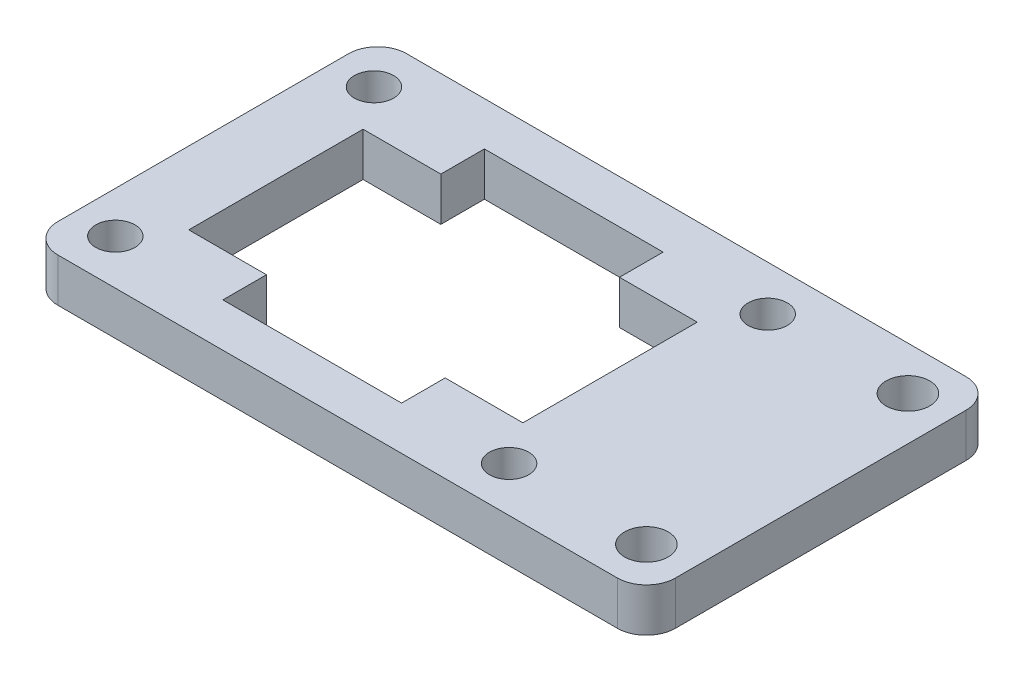
ISO-10303-21;
HEADER;
FILE_DESCRIPTION(('STEP AP214'),'2;1');
FILE_NAME('part.step','',(''),(''),'','','');
FILE_SCHEMA(('AUTOMOTIVE_DESIGN { 1 0 10303 214 1 1 1 1 }'));
ENDSEC;
DATA;
#1=APPLICATION_CONTEXT('core data for automotive mechanical design processes');
#2=APPLICATION_PROTOCOL_DEFINITION('international standard','automotive_design',2000,#1);
#3=PRODUCT_CONTEXT('',#1,'mechanical');
#4=PRODUCT('Part','Part','',(#3));
#5=PRODUCT_RELATED_PRODUCT_CATEGORY('part','',(#4));
#6=PRODUCT_DEFINITION_FORMATION('','',#4);
#7=PRODUCT_DEFINITION_CONTEXT('part definition',#1,'design');
#8=PRODUCT_DEFINITION('design','',#6,#7);
#9=PRODUCT_DEFINITION_SHAPE('','',#8);
#10=(LENGTH_UNIT() NAMED_UNIT(*) SI_UNIT(.MILLI.,.METRE.));
#11=(NAMED_UNIT(*) PLANE_ANGLE_UNIT() SI_UNIT($,.RADIAN.));
#12=(NAMED_UNIT(*) SI_UNIT($,.STERADIAN.) SOLID_ANGLE_UNIT());
#13=UNCERTAINTY_MEASURE_WITH_UNIT(LENGTH_MEASURE(1.E-05),#10,'distance_accuracy_value','');
#14=(GEOMETRIC_REPRESENTATION_CONTEXT(3) GLOBAL_UNCERTAINTY_ASSIGNED_CONTEXT((#13)) GLOBAL_UNIT_ASSIGNED_CONTEXT((#10,
#11,#12)) REPRESENTATION_CONTEXT('',''));
#15=CARTESIAN_POINT('',(0.,0.,0.));
#16=DIRECTION('',(0.,0.,1.));
#17=DIRECTION('',(1.,0.,0.));
#18=AXIS2_PLACEMENT_3D('',#15,#16,#17);
#19=CARTESIAN_POINT('',(0.,3.,-6.));
#20=DIRECTION('',(0.,0.,-1.));
#21=DIRECTION('',(-1.,0.,0.));
#22=AXIS2_PLACEMENT_3D('',#19,#20,#21);
#23=PLANE('',#22);
#24=DIRECTION('',(0.,1.,0.));
#25=VECTOR('',#24,1.);
#26=CARTESIAN_POINT('',(22.65,0.,-6.));
#27=LINE('',#26,#25);
#28=CARTESIAN_POINT('',(22.65,0.,-6.));
#29=VERTEX_POINT('',#28);
#30=CARTESIAN_POINT('',(22.65,3.,-6.));
#31=VERTEX_POINT('',#30);
#32=EDGE_CURVE('E329',#29,#31,#27,.T.);
#33=ORIENTED_EDGE('',*,*,#32,.T.);
#34=DIRECTION('',(1.,0.,0.));
#35=VECTOR('',#34,1.);
#36=CARTESIAN_POINT('',(0.,3.,-6.));
#37=LINE('',#36,#35);
#38=CARTESIAN_POINT('',(28.,3.,-6.));
#39=VERTEX_POINT('',#38);
#40=EDGE_CURVE('E358',#31,#39,#37,.T.);
#41=ORIENTED_EDGE('',*,*,#40,.T.);
#42=DIRECTION('',(0.,-1.,0.));
#43=VECTOR('',#42,1.);
#44=CARTESIAN_POINT('',(28.,3.,-6.));
#45=LINE('',#44,#43);
#46=CARTESIAN_POINT('',(28.,0.,-6.));
#47=VERTEX_POINT('',#46);
#48=EDGE_CURVE('E222',#39,#47,#45,.T.);
#49=ORIENTED_EDGE('',*,*,#48,.T.);
#50=DIRECTION('',(1.,0.,0.));
#51=VECTOR('',#50,1.);
#52=CARTESIAN_POINT('',(0.,0.,-6.));
#53=LINE('',#52,#51);
#54=EDGE_CURVE('E289',#29,#47,#53,.T.);
#55=ORIENTED_EDGE('',*,*,#54,.F.);
#56=EDGE_LOOP('',(#33,#41,#49,#55));
#57=FACE_BOUND('',#56,.T.);
#58=ADVANCED_FACE('F35',(#57),#23,.T.);
#59=CARTESIAN_POINT('',(0.,3.,-3.));
#60=DIRECTION('',(0.,0.,-1.));
#61=DIRECTION('',(-1.,0.,0.));
#62=AXIS2_PLACEMENT_3D('',#59,#60,#61);
#63=PLANE('',#62);
#64=DIRECTION('',(1.,0.,0.));
#65=VECTOR('',#64,1.);
#66=CARTESIAN_POINT('',(0.,0.,-3.));
#67=LINE('',#66,#65);
#68=CARTESIAN_POINT('',(10.35,0.,-3.));
#69=VERTEX_POINT('',#68);
#70=CARTESIAN_POINT('',(22.65,0.,-3.));
#71=VERTEX_POINT('',#70);
#72=EDGE_CURVE('E291',#69,#71,#67,.T.);
#73=ORIENTED_EDGE('',*,*,#72,.F.);
#74=DIRECTION('',(0.,1.,0.));
#75=VECTOR('',#74,1.);
#76=CARTESIAN_POINT('',(10.35,0.,-3.));
#77=LINE('',#76,#75);
#78=CARTESIAN_POINT('',(10.35,3.,-3.));
#79=VERTEX_POINT('',#78);
#80=EDGE_CURVE('E307',#69,#79,#77,.T.);
#81=ORIENTED_EDGE('',*,*,#80,.T.);
#82=DIRECTION('',(1.,0.,0.));
#83=VECTOR('',#82,1.);
#84=CARTESIAN_POINT('',(0.,3.,-3.));
#85=LINE('',#84,#83);
#86=CARTESIAN_POINT('',(22.65,3.,-3.));
#87=VERTEX_POINT('',#86);
#88=EDGE_CURVE('E360',#79,#87,#85,.T.);
#89=ORIENTED_EDGE('',*,*,#88,.T.);
#90=DIRECTION('',(0.,1.,0.));
#91=VECTOR('',#90,1.);
#92=CARTESIAN_POINT('',(22.65,0.,-3.));
#93=LINE('',#92,#91);
#94=EDGE_CURVE('E327',#71,#87,#93,.T.);
#95=ORIENTED_EDGE('',*,*,#94,.F.);
#96=EDGE_LOOP('',(#73,#81,#89,#95));
#97=FACE_BOUND('',#96,.T.);
#98=ADVANCED_FACE('F404',(#97),#63,.T.);
#99=DIRECTION('',(0.,1.,0.));
#100=VECTOR('',#99,1.);
#101=CARTESIAN_POINT('',(10.35,0.,-6.));
#102=LINE('',#101,#100);
#103=CARTESIAN_POINT('',(10.35,0.,-6.));
#104=VERTEX_POINT('',#103);
#105=CARTESIAN_POINT('',(10.35,3.,-6.));
#106=VERTEX_POINT('',#105);
#107=EDGE_CURVE('E302',#104,#106,#102,.T.);
#108=ORIENTED_EDGE('',*,*,#107,.F.);
#109=CARTESIAN_POINT('',(5.,0.,-6.));
#110=VERTEX_POINT('',#109);
#111=EDGE_CURVE('E204',#110,#104,#53,.T.);
#112=ORIENTED_EDGE('',*,*,#111,.F.);
#113=DIRECTION('',(0.,-1.,0.));
#114=VECTOR('',#113,1.);
#115=CARTESIAN_POINT('',(5.,3.,-6.));
#116=LINE('',#115,#114);
#117=CARTESIAN_POINT('',(5.,3.,-6.));
#118=VERTEX_POINT('',#117);
#119=EDGE_CURVE('E229',#118,#110,#116,.T.);
#120=ORIENTED_EDGE('',*,*,#119,.F.);
#121=EDGE_CURVE('E303',#118,#106,#37,.T.);
#122=ORIENTED_EDGE('',*,*,#121,.T.);
#123=EDGE_LOOP('',(#108,#112,#120,#122));
#124=FACE_BOUND('',#123,.T.);
#125=ADVANCED_FACE('F299',(#124),#23,.T.);
#126=CARTESIAN_POINT('',(5.,3.,0.));
#127=DIRECTION('',(1.,0.,0.));
#128=DIRECTION('',(0.,0.,-1.));
#129=AXIS2_PLACEMENT_3D('',#126,#127,#128);
#130=PLANE('',#129);
#131=DIRECTION('',(0.,0.,1.));
#132=VECTOR('',#131,1.);
#133=CARTESIAN_POINT('',(5.,0.,0.));
#134=LINE('',#133,#132);
#135=CARTESIAN_POINT('',(5.,0.,-18.));
#136=VERTEX_POINT('',#135);
#137=EDGE_CURVE('E200',#136,#110,#134,.T.);
#138=ORIENTED_EDGE('',*,*,#137,.F.);
#139=DIRECTION('',(0.,-1.,0.));
#140=VECTOR('',#139,1.);
#141=CARTESIAN_POINT('',(5.,3.,-18.));
#142=LINE('',#141,#140);
#143=CARTESIAN_POINT('',(5.,3.,-18.));
#144=VERTEX_POINT('',#143);
#145=EDGE_CURVE('E199',#144,#136,#142,.T.);
#146=ORIENTED_EDGE('',*,*,#145,.F.);
#147=DIRECTION('',(0.,0.,1.));
#148=VECTOR('',#147,1.);
#149=CARTESIAN_POINT('',(5.,3.,0.));
#150=LINE('',#149,#148);
#151=EDGE_CURVE('E362',#144,#118,#150,.T.);
#152=ORIENTED_EDGE('',*,*,#151,.T.);
#153=ORIENTED_EDGE('',*,*,#119,.T.);
#154=EDGE_LOOP('',(#138,#146,#152,#153));
#155=FACE_BOUND('',#154,.T.);
#156=ADVANCED_FACE('F414',(#155),#130,.T.);
#157=CARTESIAN_POINT('',(0.,3.,-18.));
#158=DIRECTION('',(0.,0.,-1.));
#159=DIRECTION('',(-1.,0.,0.));
#160=AXIS2_PLACEMENT_3D('',#157,#158,#159);
#161=PLANE('',#160);
#162=DIRECTION('',(1.,0.,0.));
#163=VECTOR('',#162,1.);
#164=CARTESIAN_POINT('',(0.,0.,-18.));
#165=LINE('',#164,#163);
#166=CARTESIAN_POINT('',(10.35,0.,-18.));
#167=VERTEX_POINT('',#166);
#168=EDGE_CURVE('E193',#136,#167,#165,.T.);
#169=ORIENTED_EDGE('',*,*,#168,.T.);
#170=DIRECTION('',(0.,1.,0.));
#171=VECTOR('',#170,1.);
#172=CARTESIAN_POINT('',(10.35,0.,-18.));
#173=LINE('',#172,#171);
#174=CARTESIAN_POINT('',(10.35,3.,-18.));
#175=VERTEX_POINT('',#174);
#176=EDGE_CURVE('E173',#167,#175,#173,.T.);
#177=ORIENTED_EDGE('',*,*,#176,.T.);
#178=DIRECTION('',(1.,0.,0.));
#179=VECTOR('',#178,1.);
#180=CARTESIAN_POINT('',(0.,3.,-18.));
#181=LINE('',#180,#179);
#182=EDGE_CURVE('E365',#144,#175,#181,.T.);
#183=ORIENTED_EDGE('',*,*,#182,.F.);
#184=ORIENTED_EDGE('',*,*,#145,.T.);
#185=EDGE_LOOP('',(#169,#177,#183,#184));
#186=FACE_BOUND('',#185,.T.);
#187=ADVANCED_FACE('F198',(#186),#161,.F.);
#188=CARTESIAN_POINT('',(0.,3.,-21.));
#189=DIRECTION('',(0.,0.,-1.));
#190=DIRECTION('',(-1.,0.,0.));
#191=AXIS2_PLACEMENT_3D('',#188,#189,#190);
#192=PLANE('',#191);
#193=DIRECTION('',(1.,0.,0.));
#194=VECTOR('',#193,1.);
#195=CARTESIAN_POINT('',(0.,0.,-21.));
#196=LINE('',#195,#194);
#197=CARTESIAN_POINT('',(10.35,0.,-21.));
#198=VERTEX_POINT('',#197);
#199=CARTESIAN_POINT('',(22.65,0.,-21.));
#200=VERTEX_POINT('',#199);
#201=EDGE_CURVE('E196',#198,#200,#196,.T.);
#202=ORIENTED_EDGE('',*,*,#201,.T.);
#203=DIRECTION('',(0.,1.,0.));
#204=VECTOR('',#203,1.);
#205=CARTESIAN_POINT('',(22.65,0.,-21.));
#206=LINE('',#205,#204);
#207=CARTESIAN_POINT('',(22.65,3.,-21.));
#208=VERTEX_POINT('',#207);
#209=EDGE_CURVE('E321',#200,#208,#206,.T.);
#210=ORIENTED_EDGE('',*,*,#209,.T.);
#211=DIRECTION('',(1.,0.,0.));
#212=VECTOR('',#211,1.);
#213=CARTESIAN_POINT('',(0.,3.,-21.));
#214=LINE('',#213,#212);
#215=CARTESIAN_POINT('',(10.35,3.,-21.));
#216=VERTEX_POINT('',#215);
#217=EDGE_CURVE('E367',#216,#208,#214,.T.);
#218=ORIENTED_EDGE('',*,*,#217,.F.);
#219=DIRECTION('',(0.,1.,0.));
#220=VECTOR('',#219,1.);
#221=CARTESIAN_POINT('',(10.35,0.,-21.));
#222=LINE('',#221,#220);
#223=EDGE_CURVE('E186',#198,#216,#222,.T.);
#224=ORIENTED_EDGE('',*,*,#223,.F.);
#225=EDGE_LOOP('',(#202,#210,#218,#224));
#226=FACE_BOUND('',#225,.T.);
#227=ADVANCED_FACE('F422',(#226),#192,.F.);
#228=CARTESIAN_POINT('',(22.65,3.,-18.));
#229=VERTEX_POINT('',#228);
#230=CARTESIAN_POINT('',(28.,3.,-18.));
#231=VERTEX_POINT('',#230);
#232=EDGE_CURVE('E368',#229,#231,#181,.T.);
#233=ORIENTED_EDGE('',*,*,#232,.F.);
#234=DIRECTION('',(0.,1.,0.));
#235=VECTOR('',#234,1.);
#236=CARTESIAN_POINT('',(22.65,0.,-18.));
#237=LINE('',#236,#235);
#238=CARTESIAN_POINT('',(22.65,0.,-18.));
#239=VERTEX_POINT('',#238);
#240=EDGE_CURVE('E318',#239,#229,#237,.T.);
#241=ORIENTED_EDGE('',*,*,#240,.F.);
#242=CARTESIAN_POINT('',(28.,0.,-18.));
#243=VERTEX_POINT('',#242);
#244=EDGE_CURVE('E202',#239,#243,#165,.T.);
#245=ORIENTED_EDGE('',*,*,#244,.T.);
#246=DIRECTION('',(0.,-1.,0.));
#247=VECTOR('',#246,1.);
#248=CARTESIAN_POINT('',(28.,3.,-18.));
#249=LINE('',#248,#247);
#250=EDGE_CURVE('E225',#231,#243,#249,.T.);
#251=ORIENTED_EDGE('',*,*,#250,.F.);
#252=EDGE_LOOP('',(#233,#241,#245,#251));
#253=FACE_BOUND('',#252,.T.);
#254=ADVANCED_FACE('F424',(#253),#161,.F.);
#255=CARTESIAN_POINT('',(0.,3.,0.));
#256=DIRECTION('',(0.,0.,-1.));
#257=DIRECTION('',(-1.,0.,0.));
#258=AXIS2_PLACEMENT_3D('',#255,#256,#257);
#259=PLANE('',#258);
#260=DIRECTION('',(1.,0.,0.));
#261=VECTOR('',#260,1.);
#262=CARTESIAN_POINT('',(0.,0.,0.));
#263=LINE('',#262,#261);
#264=CARTESIAN_POINT('',(2.,0.,0.));
#265=VERTEX_POINT('',#264);
#266=CARTESIAN_POINT('',(40.5,0.,0.));
#267=VERTEX_POINT('',#266);
#268=EDGE_CURVE('E266',#265,#267,#263,.T.);
#269=ORIENTED_EDGE('',*,*,#268,.T.);
#270=DIRECTION('',(0.,-1.,0.));
#271=VECTOR('',#270,1.);
#272=CARTESIAN_POINT('',(40.5,3.,0.));
#273=LINE('',#272,#271);
#274=CARTESIAN_POINT('',(40.5,3.,0.));
#275=VERTEX_POINT('',#274);
#276=EDGE_CURVE('E11',#267,#275,#273,.F.);
#277=ORIENTED_EDGE('',*,*,#276,.T.);
#278=DIRECTION('',(1.,0.,0.));
#279=VECTOR('',#278,1.);
#280=CARTESIAN_POINT('',(0.,3.,0.));
#281=LINE('',#280,#279);
#282=CARTESIAN_POINT('',(2.,3.,0.));
#283=VERTEX_POINT('',#282);
#284=EDGE_CURVE('E268',#283,#275,#281,.T.);
#285=ORIENTED_EDGE('',*,*,#284,.F.);
#286=DIRECTION('',(0.,-1.,0.));
#287=VECTOR('',#286,1.);
#288=CARTESIAN_POINT('',(2.,0.,0.));
#289=LINE('',#288,#287);
#290=EDGE_CURVE('E43',#283,#265,#289,.T.);
#291=ORIENTED_EDGE('',*,*,#290,.T.);
#292=EDGE_LOOP('',(#269,#277,#285,#291));
#293=FACE_BOUND('',#292,.T.);
#294=ADVANCED_FACE('F265',(#293),#259,.F.);
#295=CARTESIAN_POINT('',(42.5,3.,0.));
#296=DIRECTION('',(-1.,0.,0.));
#297=DIRECTION('',(0.,0.,1.));
#298=AXIS2_PLACEMENT_3D('',#295,#296,#297);
#299=PLANE('',#298);
#300=DIRECTION('',(0.,0.,-1.));
#301=VECTOR('',#300,1.);
#302=CARTESIAN_POINT('',(42.5,0.,0.));
#303=LINE('',#302,#301);
#304=CARTESIAN_POINT('',(42.5,0.,-2.));
#305=VERTEX_POINT('',#304);
#306=CARTESIAN_POINT('',(42.5,0.,-22.));
#307=VERTEX_POINT('',#306);
#308=EDGE_CURVE('E275',#305,#307,#303,.T.);
#309=ORIENTED_EDGE('',*,*,#308,.T.);
#310=DIRECTION('',(0.,-1.,0.));
#311=VECTOR('',#310,1.);
#312=CARTESIAN_POINT('',(42.5,3.,-22.));
#313=LINE('',#312,#311);
#314=CARTESIAN_POINT('',(42.5,3.,-22.));
#315=VERTEX_POINT('',#314);
#316=EDGE_CURVE('E50',#307,#315,#313,.F.);
#317=ORIENTED_EDGE('',*,*,#316,.T.);
#318=DIRECTION('',(0.,0.,-1.));
#319=VECTOR('',#318,1.);
#320=CARTESIAN_POINT('',(42.5,3.,0.));
#321=LINE('',#320,#319);
#322=CARTESIAN_POINT('',(42.5,3.,-2.));
#323=VERTEX_POINT('',#322);
#324=EDGE_CURVE('E350',#323,#315,#321,.T.);
#325=ORIENTED_EDGE('',*,*,#324,.F.);
#326=DIRECTION('',(0.,-1.,0.));
#327=VECTOR('',#326,1.);
#328=CARTESIAN_POINT('',(42.5,3.,-2.));
#329=LINE('',#328,#327);
#330=EDGE_CURVE('E256',#323,#305,#329,.T.);
#331=ORIENTED_EDGE('',*,*,#330,.T.);
#332=EDGE_LOOP('',(#309,#317,#325,#331));
#333=FACE_BOUND('',#332,.T.);
#334=ADVANCED_FACE('F539',(#333),#299,.F.);
#335=CARTESIAN_POINT('',(0.,3.,-24.));
#336=DIRECTION('',(0.,0.,-1.));
#337=DIRECTION('',(-1.,0.,0.));
#338=AXIS2_PLACEMENT_3D('',#335,#336,#337);
#339=PLANE('',#338);
#340=DIRECTION('',(1.,0.,0.));
#341=VECTOR('',#340,1.);
#342=CARTESIAN_POINT('',(0.,0.,-24.));
#343=LINE('',#342,#341);
#344=CARTESIAN_POINT('',(2.,0.,-24.));
#345=VERTEX_POINT('',#344);
#346=CARTESIAN_POINT('',(40.5,0.,-24.));
#347=VERTEX_POINT('',#346);
#348=EDGE_CURVE('E278',#345,#347,#343,.T.);
#349=ORIENTED_EDGE('',*,*,#348,.F.);
#350=DIRECTION('',(0.,-1.,0.));
#351=VECTOR('',#350,1.);
#352=CARTESIAN_POINT('',(2.,3.,-24.));
#353=LINE('',#352,#351);
#354=CARTESIAN_POINT('',(2.,3.,-24.));
#355=VERTEX_POINT('',#354);
#356=EDGE_CURVE('E247',#345,#355,#353,.F.);
#357=ORIENTED_EDGE('',*,*,#356,.T.);
#358=DIRECTION('',(1.,0.,0.));
#359=VECTOR('',#358,1.);
#360=CARTESIAN_POINT('',(0.,3.,-24.));
#361=LINE('',#360,#359);
#362=CARTESIAN_POINT('',(40.5,3.,-24.));
#363=VERTEX_POINT('',#362);
#364=EDGE_CURVE('E352',#355,#363,#361,.T.);
#365=ORIENTED_EDGE('',*,*,#364,.T.);
#366=DIRECTION('',(0.,-1.,0.));
#367=VECTOR('',#366,1.);
#368=CARTESIAN_POINT('',(40.5,0.,-24.));
#369=LINE('',#368,#367);
#370=EDGE_CURVE('E244',#363,#347,#369,.T.);
#371=ORIENTED_EDGE('',*,*,#370,.T.);
#372=EDGE_LOOP('',(#349,#357,#365,#371));
#373=FACE_BOUND('',#372,.T.);
#374=ADVANCED_FACE('F545',(#373),#339,.T.);
#375=CARTESIAN_POINT('',(0.,3.,0.));
#376=DIRECTION('',(-1.,0.,0.));
#377=DIRECTION('',(0.,0.,1.));
#378=AXIS2_PLACEMENT_3D('',#375,#376,#377);
#379=PLANE('',#378);
#380=DIRECTION('',(0.,0.,-1.));
#381=VECTOR('',#380,1.);
#382=CARTESIAN_POINT('',(0.,3.,0.));
#383=LINE('',#382,#381);
#384=CARTESIAN_POINT('',(0.,3.,-2.));
#385=VERTEX_POINT('',#384);
#386=CARTESIAN_POINT('',(0.,3.,-22.));
#387=VERTEX_POINT('',#386);
#388=EDGE_CURVE('E355',#385,#387,#383,.T.);
#389=ORIENTED_EDGE('',*,*,#388,.T.);
#390=DIRECTION('',(0.,-1.,0.));
#391=VECTOR('',#390,1.);
#392=CARTESIAN_POINT('',(0.,3.,-22.));
#393=LINE('',#392,#391);
#394=CARTESIAN_POINT('',(0.,0.,-22.));
#395=VERTEX_POINT('',#394);
#396=EDGE_CURVE('E233',#387,#395,#393,.T.);
#397=ORIENTED_EDGE('',*,*,#396,.T.);
#398=DIRECTION('',(0.,0.,-1.));
#399=VECTOR('',#398,1.);
#400=CARTESIAN_POINT('',(0.,0.,0.));
#401=LINE('',#400,#399);
#402=CARTESIAN_POINT('',(0.,0.,-2.));
#403=VERTEX_POINT('',#402);
#404=EDGE_CURVE('E287',#403,#395,#401,.T.);
#405=ORIENTED_EDGE('',*,*,#404,.F.);
#406=DIRECTION('',(0.,-1.,0.));
#407=VECTOR('',#406,1.);
#408=CARTESIAN_POINT('',(0.,3.,-2.));
#409=LINE('',#408,#407);
#410=EDGE_CURVE('E231',#403,#385,#409,.F.);
#411=ORIENTED_EDGE('',*,*,#410,.T.);
#412=EDGE_LOOP('',(#389,#397,#405,#411));
#413=FACE_BOUND('',#412,.T.);
#414=ADVANCED_FACE('F400',(#413),#379,.T.);
#415=CARTESIAN_POINT('',(2.85,3.,-20.9));
#416=DIRECTION('',(0.,-1.,0.));
#417=DIRECTION('',(0.,0.,-1.));
#418=AXIS2_PLACEMENT_3D('',#415,#416,#417);
#419=CYLINDRICAL_SURFACE('',#418,1.35);
#420=CARTESIAN_POINT('',(2.85,3.,-20.9));
#421=DIRECTION('',(0.,1.,0.));
#422=DIRECTION('',(0.,0.,1.));
#423=AXIS2_PLACEMENT_3D('',#420,#421,#422);
#424=CIRCLE('',#423,1.35);
#425=CARTESIAN_POINT('',(2.85,3.,-19.55));
#426=VERTEX_POINT('',#425);
#427=EDGE_CURVE('E346',#426,#426,#424,.T.);
#428=ORIENTED_EDGE('',*,*,#427,.T.);
#429=EDGE_LOOP('',(#428));
#430=FACE_BOUND('',#429,.T.);
#431=CARTESIAN_POINT('',(2.85,0.,-20.9));
#432=DIRECTION('',(0.,1.,0.));
#433=DIRECTION('',(0.,0.,1.));
#434=AXIS2_PLACEMENT_3D('',#431,#432,#433);
#435=CIRCLE('',#434,1.35);
#436=CARTESIAN_POINT('',(2.85,0.,-19.55));
#437=VERTEX_POINT('',#436);
#438=EDGE_CURVE('E276',#437,#437,#435,.T.);
#439=ORIENTED_EDGE('',*,*,#438,.F.);
#440=EDGE_LOOP('',(#439));
#441=FACE_BOUND('',#440,.T.);
#442=ADVANCED_FACE('F390',(#430,#441),#419,.F.);
#443=CARTESIAN_POINT('',(2.85,3.,-3.1));
#444=DIRECTION('',(0.,-1.,0.));
#445=DIRECTION('',(0.,0.,-1.));
#446=AXIS2_PLACEMENT_3D('',#443,#444,#445);
#447=CYLINDRICAL_SURFACE('',#446,1.35);
#448=CARTESIAN_POINT('',(2.85,3.,-3.1));
#449=DIRECTION('',(0.,1.,0.));
#450=DIRECTION('',(0.,0.,1.));
#451=AXIS2_PLACEMENT_3D('',#448,#449,#450);
#452=CIRCLE('',#451,1.35);
#453=CARTESIAN_POINT('',(2.85,3.,-1.75));
#454=VERTEX_POINT('',#453);
#455=EDGE_CURVE('E343',#454,#454,#452,.T.);
#456=ORIENTED_EDGE('',*,*,#455,.T.);
#457=EDGE_LOOP('',(#456));
#458=FACE_BOUND('',#457,.T.);
#459=CARTESIAN_POINT('',(2.85,0.,-3.1));
#460=DIRECTION('',(0.,1.,0.));
#461=DIRECTION('',(0.,0.,1.));
#462=AXIS2_PLACEMENT_3D('',#459,#460,#461);
#463=CIRCLE('',#462,1.35);
#464=CARTESIAN_POINT('',(2.85,0.,-1.75));
#465=VERTEX_POINT('',#464);
#466=EDGE_CURVE('E281',#465,#465,#463,.T.);
#467=ORIENTED_EDGE('',*,*,#466,.F.);
#468=EDGE_LOOP('',(#467));
#469=FACE_BOUND('',#468,.T.);
#470=ADVANCED_FACE('F387',(#458,#469),#447,.F.);
#471=CARTESIAN_POINT('',(29.95,3.,-20.9));
#472=DIRECTION('',(0.,-1.,0.));
#473=DIRECTION('',(0.,0.,-1.));
#474=AXIS2_PLACEMENT_3D('',#471,#472,#473);
#475=CYLINDRICAL_SURFACE('',#474,1.35);
#476=CARTESIAN_POINT('',(29.95,3.,-20.9));
#477=DIRECTION('',(0.,1.,0.));
#478=DIRECTION('',(0.,0.,1.));
#479=AXIS2_PLACEMENT_3D('',#476,#477,#478);
#480=CIRCLE('',#479,1.35);
#481=CARTESIAN_POINT('',(29.95,3.,-19.55));
#482=VERTEX_POINT('',#481);
#483=EDGE_CURVE('E340',#482,#482,#480,.T.);
#484=ORIENTED_EDGE('',*,*,#483,.T.);
#485=EDGE_LOOP('',(#484));
#486=FACE_BOUND('',#485,.T.);
#487=CARTESIAN_POINT('',(29.95,0.,-20.9));
#488=DIRECTION('',(0.,1.,0.));
#489=DIRECTION('',(0.,0.,1.));
#490=AXIS2_PLACEMENT_3D('',#487,#488,#489);
#491=CIRCLE('',#490,1.35);
#492=CARTESIAN_POINT('',(29.95,0.,-19.55));
#493=VERTEX_POINT('',#492);
#494=EDGE_CURVE('E380',#493,#493,#491,.T.);
#495=ORIENTED_EDGE('',*,*,#494,.F.);
#496=EDGE_LOOP('',(#495));
#497=FACE_BOUND('',#496,.T.);
#498=ADVANCED_FACE('F389',(#486,#497),#475,.F.);
#499=CARTESIAN_POINT('',(29.95,3.,-3.1));
#500=DIRECTION('',(0.,-1.,0.));
#501=DIRECTION('',(0.,0.,-1.));
#502=AXIS2_PLACEMENT_3D('',#499,#500,#501);
#503=CYLINDRICAL_SURFACE('',#502,1.35);
#504=CARTESIAN_POINT('',(29.95,3.,-3.1));
#505=DIRECTION('',(0.,1.,0.));
#506=DIRECTION('',(0.,0.,1.));
#507=AXIS2_PLACEMENT_3D('',#504,#505,#506);
#508=CIRCLE('',#507,1.35);
#509=CARTESIAN_POINT('',(29.95,3.,-1.75));
#510=VERTEX_POINT('',#509);
#511=EDGE_CURVE('E337',#510,#510,#508,.T.);
#512=ORIENTED_EDGE('',*,*,#511,.T.);
#513=EDGE_LOOP('',(#512));
#514=FACE_BOUND('',#513,.T.);
#515=CARTESIAN_POINT('',(29.95,0.,-3.1));
#516=DIRECTION('',(0.,1.,0.));
#517=DIRECTION('',(0.,0.,1.));
#518=AXIS2_PLACEMENT_3D('',#515,#516,#517);
#519=CIRCLE('',#518,1.35);
#520=CARTESIAN_POINT('',(29.95,0.,-1.75));
#521=VERTEX_POINT('',#520);
#522=EDGE_CURVE('E377',#521,#521,#519,.T.);
#523=ORIENTED_EDGE('',*,*,#522,.F.);
#524=EDGE_LOOP('',(#523));
#525=FACE_BOUND('',#524,.T.);
#526=ADVANCED_FACE('F397',(#514,#525),#503,.F.);
#527=CARTESIAN_POINT('',(39.5,3.,-3.));
#528=DIRECTION('',(0.,-1.,0.));
#529=DIRECTION('',(0.,0.,-1.));
#530=AXIS2_PLACEMENT_3D('',#527,#528,#529);
#531=CYLINDRICAL_SURFACE('',#530,1.5);
#532=CARTESIAN_POINT('',(39.5,3.,-3.));
#533=DIRECTION('',(0.,1.,0.));
#534=DIRECTION('',(0.,0.,1.));
#535=AXIS2_PLACEMENT_3D('',#532,#533,#534);
#536=CIRCLE('',#535,1.5);
#537=CARTESIAN_POINT('',(39.5,3.,-1.5));
#538=VERTEX_POINT('',#537);
#539=EDGE_CURVE('E219',#538,#538,#536,.T.);
#540=ORIENTED_EDGE('',*,*,#539,.T.);
#541=EDGE_LOOP('',(#540));
#542=FACE_BOUND('',#541,.T.);
#543=CARTESIAN_POINT('',(39.5,0.,-3.));
#544=DIRECTION('',(0.,1.,0.));
#545=DIRECTION('',(0.,0.,1.));
#546=AXIS2_PLACEMENT_3D('',#543,#544,#545);
#547=CIRCLE('',#546,1.5);
#548=CARTESIAN_POINT('',(39.5,0.,-1.5));
#549=VERTEX_POINT('',#548);
#550=EDGE_CURVE('E374',#549,#549,#547,.T.);
#551=ORIENTED_EDGE('',*,*,#550,.F.);
#552=EDGE_LOOP('',(#551));
#553=FACE_BOUND('',#552,.T.);
#554=ADVANCED_FACE('F586',(#542,#553),#531,.F.);
#555=CARTESIAN_POINT('',(39.5,3.,-21.));
#556=DIRECTION('',(0.,-1.,0.));
#557=DIRECTION('',(0.,0.,-1.));
#558=AXIS2_PLACEMENT_3D('',#555,#556,#557);
#559=CYLINDRICAL_SURFACE('',#558,1.5);
#560=CARTESIAN_POINT('',(39.5,3.,-21.));
#561=DIRECTION('',(0.,1.,0.));
#562=DIRECTION('',(0.,0.,1.));
#563=AXIS2_PLACEMENT_3D('',#560,#561,#562);
#564=CIRCLE('',#563,1.5);
#565=CARTESIAN_POINT('',(39.5,3.,-19.5));
#566=VERTEX_POINT('',#565);
#567=EDGE_CURVE('E213',#566,#566,#564,.T.);
#568=ORIENTED_EDGE('',*,*,#567,.T.);
#569=EDGE_LOOP('',(#568));
#570=FACE_BOUND('',#569,.T.);
#571=CARTESIAN_POINT('',(39.5,0.,-21.));
#572=DIRECTION('',(0.,1.,0.));
#573=DIRECTION('',(0.,0.,1.));
#574=AXIS2_PLACEMENT_3D('',#571,#572,#573);
#575=CIRCLE('',#574,1.5);
#576=CARTESIAN_POINT('',(39.5,0.,-19.5));
#577=VERTEX_POINT('',#576);
#578=EDGE_CURVE('E332',#577,#577,#575,.T.);
#579=ORIENTED_EDGE('',*,*,#578,.F.);
#580=EDGE_LOOP('',(#579));
#581=FACE_BOUND('',#580,.T.);
#582=ADVANCED_FACE('F434',(#570,#581),#559,.F.);
#583=CARTESIAN_POINT('',(28.,3.,0.));
#584=DIRECTION('',(1.,0.,0.));
#585=DIRECTION('',(0.,0.,-1.));
#586=AXIS2_PLACEMENT_3D('',#583,#584,#585);
#587=PLANE('',#586);
#588=DIRECTION('',(0.,0.,1.));
#589=VECTOR('',#588,1.);
#590=CARTESIAN_POINT('',(28.,0.,0.));
#591=LINE('',#590,#589);
#592=EDGE_CURVE('E206',#243,#47,#591,.T.);
#593=ORIENTED_EDGE('',*,*,#592,.T.);
#594=ORIENTED_EDGE('',*,*,#48,.F.);
#595=DIRECTION('',(0.,0.,1.));
#596=VECTOR('',#595,1.);
#597=CARTESIAN_POINT('',(28.,3.,0.));
#598=LINE('',#597,#596);
#599=EDGE_CURVE('E226',#231,#39,#598,.T.);
#600=ORIENTED_EDGE('',*,*,#599,.F.);
#601=ORIENTED_EDGE('',*,*,#250,.T.);
#602=EDGE_LOOP('',(#593,#594,#600,#601));
#603=FACE_BOUND('',#602,.T.);
#604=ADVANCED_FACE('F430',(#603),#587,.F.);
#605=CARTESIAN_POINT('',(0.,3.,0.));
#606=DIRECTION('',(0.,1.,0.));
#607=DIRECTION('',(0.,0.,1.));
#608=AXIS2_PLACEMENT_3D('',#605,#606,#607);
#609=PLANE('',#608);
#610=ORIENTED_EDGE('',*,*,#88,.F.);
#611=DIRECTION('',(0.,0.,1.));
#612=VECTOR('',#611,1.);
#613=CARTESIAN_POINT('',(10.35,3.,-6.));
#614=LINE('',#613,#612);
#615=EDGE_CURVE('E312',#106,#79,#614,.T.);
#616=ORIENTED_EDGE('',*,*,#615,.F.);
#617=ORIENTED_EDGE('',*,*,#121,.F.);
#618=ORIENTED_EDGE('',*,*,#151,.F.);
#619=ORIENTED_EDGE('',*,*,#182,.T.);
#620=DIRECTION('',(0.,0.,1.));
#621=VECTOR('',#620,1.);
#622=CARTESIAN_POINT('',(10.35,3.,-18.));
#623=LINE('',#622,#621);
#624=EDGE_CURVE('E180',#216,#175,#623,.T.);
#625=ORIENTED_EDGE('',*,*,#624,.F.);
#626=ORIENTED_EDGE('',*,*,#217,.T.);
#627=DIRECTION('',(0.,0.,-1.));
#628=VECTOR('',#627,1.);
#629=CARTESIAN_POINT('',(22.65,3.,-18.));
#630=LINE('',#629,#628);
#631=EDGE_CURVE('E185',#229,#208,#630,.T.);
#632=ORIENTED_EDGE('',*,*,#631,.F.);
#633=ORIENTED_EDGE('',*,*,#232,.T.);
#634=ORIENTED_EDGE('',*,*,#599,.T.);
#635=ORIENTED_EDGE('',*,*,#40,.F.);
#636=DIRECTION('',(0.,0.,-1.));
#637=VECTOR('',#636,1.);
#638=CARTESIAN_POINT('',(22.65,3.,-6.));
#639=LINE('',#638,#637);
#640=EDGE_CURVE('E310',#87,#31,#639,.T.);
#641=ORIENTED_EDGE('',*,*,#640,.F.);
#642=EDGE_LOOP('',(#610,#616,#617,#618,#619,#625,#626,#632,#633,#634,#635,#641));
#643=FACE_BOUND('',#642,.T.);
#644=ORIENTED_EDGE('',*,*,#567,.F.);
#645=EDGE_LOOP('',(#644));
#646=FACE_BOUND('',#645,.T.);
#647=ORIENTED_EDGE('',*,*,#539,.F.);
#648=EDGE_LOOP('',(#647));
#649=FACE_BOUND('',#648,.T.);
#650=ORIENTED_EDGE('',*,*,#511,.F.);
#651=EDGE_LOOP('',(#650));
#652=FACE_BOUND('',#651,.T.);
#653=ORIENTED_EDGE('',*,*,#483,.F.);
#654=EDGE_LOOP('',(#653));
#655=FACE_BOUND('',#654,.T.);
#656=ORIENTED_EDGE('',*,*,#455,.F.);
#657=EDGE_LOOP('',(#656));
#658=FACE_BOUND('',#657,.T.);
#659=ORIENTED_EDGE('',*,*,#427,.F.);
#660=EDGE_LOOP('',(#659));
#661=FACE_BOUND('',#660,.T.);
#662=ORIENTED_EDGE('',*,*,#364,.F.);
#663=CARTESIAN_POINT('',(2.,3.,-22.));
#664=DIRECTION('',(0.,1.,0.));
#665=DIRECTION('',(0.,0.,1.));
#666=AXIS2_PLACEMENT_3D('',#663,#664,#665);
#667=CIRCLE('',#666,2.);
#668=EDGE_CURVE('E254',#355,#387,#667,.T.);
#669=ORIENTED_EDGE('',*,*,#668,.T.);
#670=ORIENTED_EDGE('',*,*,#388,.F.);
#671=CARTESIAN_POINT('',(2.,3.,-2.));
#672=DIRECTION('',(0.,1.,0.));
#673=DIRECTION('',(0.,0.,1.));
#674=AXIS2_PLACEMENT_3D('',#671,#672,#673);
#675=CIRCLE('',#674,2.);
#676=EDGE_CURVE('E249',#385,#283,#675,.T.);
#677=ORIENTED_EDGE('',*,*,#676,.T.);
#678=ORIENTED_EDGE('',*,*,#284,.T.);
#679=CARTESIAN_POINT('',(40.5,3.,-2.));
#680=DIRECTION('',(0.,1.,0.));
#681=DIRECTION('',(0.,0.,1.));
#682=AXIS2_PLACEMENT_3D('',#679,#680,#681);
#683=CIRCLE('',#682,2.);
#684=EDGE_CURVE('E57',#275,#323,#683,.T.);
#685=ORIENTED_EDGE('',*,*,#684,.T.);
#686=ORIENTED_EDGE('',*,*,#324,.T.);
#687=CARTESIAN_POINT('',(40.5,3.,-22.));
#688=DIRECTION('',(0.,1.,0.));
#689=DIRECTION('',(0.,0.,1.));
#690=AXIS2_PLACEMENT_3D('',#687,#688,#689);
#691=CIRCLE('',#690,2.);
#692=EDGE_CURVE('E252',#315,#363,#691,.T.);
#693=ORIENTED_EDGE('',*,*,#692,.T.);
#694=EDGE_LOOP('',(#662,#669,#670,#677,#678,#685,#686,#693));
#695=FACE_BOUND('',#694,.T.);
#696=ADVANCED_FACE('F433',(#643,#646,#649,#652,#655,#658,#661,#695),#609,.T.);
#697=CARTESIAN_POINT('',(0.,0.,0.));
#698=DIRECTION('',(0.,1.,0.));
#699=DIRECTION('',(0.,0.,1.));
#700=AXIS2_PLACEMENT_3D('',#697,#698,#699);
#701=PLANE('',#700);
#702=ORIENTED_EDGE('',*,*,#578,.T.);
#703=EDGE_LOOP('',(#702));
#704=FACE_BOUND('',#703,.T.);
#705=ORIENTED_EDGE('',*,*,#550,.T.);
#706=EDGE_LOOP('',(#705));
#707=FACE_BOUND('',#706,.T.);
#708=ORIENTED_EDGE('',*,*,#522,.T.);
#709=EDGE_LOOP('',(#708));
#710=FACE_BOUND('',#709,.T.);
#711=ORIENTED_EDGE('',*,*,#494,.T.);
#712=EDGE_LOOP('',(#711));
#713=FACE_BOUND('',#712,.T.);
#714=ORIENTED_EDGE('',*,*,#466,.T.);
#715=EDGE_LOOP('',(#714));
#716=FACE_BOUND('',#715,.T.);
#717=ORIENTED_EDGE('',*,*,#438,.T.);
#718=EDGE_LOOP('',(#717));
#719=FACE_BOUND('',#718,.T.);
#720=ORIENTED_EDGE('',*,*,#404,.T.);
#721=CARTESIAN_POINT('',(2.,0.,-22.));
#722=DIRECTION('',(0.,1.,0.));
#723=DIRECTION('',(0.,0.,1.));
#724=AXIS2_PLACEMENT_3D('',#721,#722,#723);
#725=CIRCLE('',#724,2.);
#726=EDGE_CURVE('E242',#395,#345,#725,.F.);
#727=ORIENTED_EDGE('',*,*,#726,.T.);
#728=ORIENTED_EDGE('',*,*,#348,.T.);
#729=CARTESIAN_POINT('',(40.5,0.,-22.));
#730=DIRECTION('',(0.,1.,0.));
#731=DIRECTION('',(0.,0.,1.));
#732=AXIS2_PLACEMENT_3D('',#729,#730,#731);
#733=CIRCLE('',#732,2.);
#734=EDGE_CURVE('E240',#347,#307,#733,.F.);
#735=ORIENTED_EDGE('',*,*,#734,.T.);
#736=ORIENTED_EDGE('',*,*,#308,.F.);
#737=CARTESIAN_POINT('',(40.5,0.,-2.));
#738=DIRECTION('',(0.,1.,0.));
#739=DIRECTION('',(0.,0.,1.));
#740=AXIS2_PLACEMENT_3D('',#737,#738,#739);
#741=CIRCLE('',#740,2.);
#742=EDGE_CURVE('E238',#305,#267,#741,.F.);
#743=ORIENTED_EDGE('',*,*,#742,.T.);
#744=ORIENTED_EDGE('',*,*,#268,.F.);
#745=CARTESIAN_POINT('',(2.,0.,-2.));
#746=DIRECTION('',(0.,1.,0.));
#747=DIRECTION('',(0.,0.,1.));
#748=AXIS2_PLACEMENT_3D('',#745,#746,#747);
#749=CIRCLE('',#748,2.);
#750=EDGE_CURVE('E236',#265,#403,#749,.F.);
#751=ORIENTED_EDGE('',*,*,#750,.T.);
#752=EDGE_LOOP('',(#720,#727,#728,#735,#736,#743,#744,#751));
#753=FACE_BOUND('',#752,.T.);
#754=DIRECTION('',(0.,0.,1.));
#755=VECTOR('',#754,1.);
#756=CARTESIAN_POINT('',(10.35,0.,-6.));
#757=LINE('',#756,#755);
#758=EDGE_CURVE('E296',#104,#69,#757,.T.);
#759=ORIENTED_EDGE('',*,*,#758,.T.);
#760=ORIENTED_EDGE('',*,*,#72,.T.);
#761=DIRECTION('',(0.,0.,-1.));
#762=VECTOR('',#761,1.);
#763=CARTESIAN_POINT('',(22.65,0.,-6.));
#764=LINE('',#763,#762);
#765=EDGE_CURVE('E325',#71,#29,#764,.T.);
#766=ORIENTED_EDGE('',*,*,#765,.T.);
#767=ORIENTED_EDGE('',*,*,#54,.T.);
#768=ORIENTED_EDGE('',*,*,#592,.F.);
#769=ORIENTED_EDGE('',*,*,#244,.F.);
#770=DIRECTION('',(0.,0.,-1.));
#771=VECTOR('',#770,1.);
#772=CARTESIAN_POINT('',(22.65,0.,-18.));
#773=LINE('',#772,#771);
#774=EDGE_CURVE('E316',#239,#200,#773,.T.);
#775=ORIENTED_EDGE('',*,*,#774,.T.);
#776=ORIENTED_EDGE('',*,*,#201,.F.);
#777=DIRECTION('',(0.,0.,1.));
#778=VECTOR('',#777,1.);
#779=CARTESIAN_POINT('',(10.35,0.,-18.));
#780=LINE('',#779,#778);
#781=EDGE_CURVE('E177',#198,#167,#780,.T.);
#782=ORIENTED_EDGE('',*,*,#781,.T.);
#783=ORIENTED_EDGE('',*,*,#168,.F.);
#784=ORIENTED_EDGE('',*,*,#137,.T.);
#785=ORIENTED_EDGE('',*,*,#111,.T.);
#786=EDGE_LOOP('',(#759,#760,#766,#767,#768,#769,#775,#776,#782,#783,#784,#785));
#787=FACE_BOUND('',#786,.T.);
#788=ADVANCED_FACE('F191',(#704,#707,#710,#713,#716,#719,#753,#787),#701,.F.);
#789=CARTESIAN_POINT('',(22.65,0.,-6.));
#790=DIRECTION('',(1.,0.,0.));
#791=DIRECTION('',(0.,0.,-1.));
#792=AXIS2_PLACEMENT_3D('',#789,#790,#791);
#793=PLANE('',#792);
#794=ORIENTED_EDGE('',*,*,#640,.T.);
#795=ORIENTED_EDGE('',*,*,#32,.F.);
#796=ORIENTED_EDGE('',*,*,#765,.F.);
#797=ORIENTED_EDGE('',*,*,#94,.T.);
#798=EDGE_LOOP('',(#794,#795,#796,#797));
#799=FACE_BOUND('',#798,.T.);
#800=ADVANCED_FACE('F437',(#799),#793,.F.);
#801=CARTESIAN_POINT('',(10.35,0.,-18.));
#802=DIRECTION('',(-1.,0.,0.));
#803=DIRECTION('',(0.,0.,1.));
#804=AXIS2_PLACEMENT_3D('',#801,#802,#803);
#805=PLANE('',#804);
#806=ORIENTED_EDGE('',*,*,#624,.T.);
#807=ORIENTED_EDGE('',*,*,#176,.F.);
#808=ORIENTED_EDGE('',*,*,#781,.F.);
#809=ORIENTED_EDGE('',*,*,#223,.T.);
#810=EDGE_LOOP('',(#806,#807,#808,#809));
#811=FACE_BOUND('',#810,.T.);
#812=ADVANCED_FACE('F175',(#811),#805,.F.);
#813=CARTESIAN_POINT('',(22.65,0.,-18.));
#814=DIRECTION('',(1.,0.,0.));
#815=DIRECTION('',(0.,0.,-1.));
#816=AXIS2_PLACEMENT_3D('',#813,#814,#815);
#817=PLANE('',#816);
#818=ORIENTED_EDGE('',*,*,#631,.T.);
#819=ORIENTED_EDGE('',*,*,#209,.F.);
#820=ORIENTED_EDGE('',*,*,#774,.F.);
#821=ORIENTED_EDGE('',*,*,#240,.T.);
#822=EDGE_LOOP('',(#818,#819,#820,#821));
#823=FACE_BOUND('',#822,.T.);
#824=ADVANCED_FACE('F445',(#823),#817,.F.);
#825=CARTESIAN_POINT('',(10.35,0.,-6.));
#826=DIRECTION('',(-1.,0.,0.));
#827=DIRECTION('',(0.,0.,1.));
#828=AXIS2_PLACEMENT_3D('',#825,#826,#827);
#829=PLANE('',#828);
#830=ORIENTED_EDGE('',*,*,#615,.T.);
#831=ORIENTED_EDGE('',*,*,#80,.F.);
#832=ORIENTED_EDGE('',*,*,#758,.F.);
#833=ORIENTED_EDGE('',*,*,#107,.T.);
#834=EDGE_LOOP('',(#830,#831,#832,#833));
#835=FACE_BOUND('',#834,.T.);
#836=ADVANCED_FACE('F448',(#835),#829,.F.);
#837=CARTESIAN_POINT('',(2.,3.,-22.));
#838=DIRECTION('',(0.,-1.,0.));
#839=DIRECTION('',(0.,0.,-1.));
#840=AXIS2_PLACEMENT_3D('',#837,#838,#839);
#841=CYLINDRICAL_SURFACE('',#840,2.);
#842=ORIENTED_EDGE('',*,*,#668,.F.);
#843=ORIENTED_EDGE('',*,*,#356,.F.);
#844=ORIENTED_EDGE('',*,*,#726,.F.);
#845=ORIENTED_EDGE('',*,*,#396,.F.);
#846=EDGE_LOOP('',(#842,#843,#844,#845));
#847=FACE_BOUND('',#846,.T.);
#848=ADVANCED_FACE('F452',(#847),#841,.T.);
#849=CARTESIAN_POINT('',(40.5,3.,-22.));
#850=DIRECTION('',(0.,1.,0.));
#851=DIRECTION('',(0.,0.,1.));
#852=AXIS2_PLACEMENT_3D('',#849,#850,#851);
#853=CYLINDRICAL_SURFACE('',#852,2.);
#854=ORIENTED_EDGE('',*,*,#692,.F.);
#855=ORIENTED_EDGE('',*,*,#316,.F.);
#856=ORIENTED_EDGE('',*,*,#734,.F.);
#857=ORIENTED_EDGE('',*,*,#370,.F.);
#858=EDGE_LOOP('',(#854,#855,#856,#857));
#859=FACE_BOUND('',#858,.T.);
#860=ADVANCED_FACE('F473',(#859),#853,.T.);
#861=CARTESIAN_POINT('',(40.5,3.,-2.));
#862=DIRECTION('',(0.,-1.,0.));
#863=DIRECTION('',(0.,0.,-1.));
#864=AXIS2_PLACEMENT_3D('',#861,#862,#863);
#865=CYLINDRICAL_SURFACE('',#864,2.);
#866=ORIENTED_EDGE('',*,*,#684,.F.);
#867=ORIENTED_EDGE('',*,*,#276,.F.);
#868=ORIENTED_EDGE('',*,*,#742,.F.);
#869=ORIENTED_EDGE('',*,*,#330,.F.);
#870=EDGE_LOOP('',(#866,#867,#868,#869));
#871=FACE_BOUND('',#870,.T.);
#872=ADVANCED_FACE('F482',(#871),#865,.T.);
#873=CARTESIAN_POINT('',(2.,3.,-2.));
#874=DIRECTION('',(0.,1.,0.));
#875=DIRECTION('',(0.,0.,1.));
#876=AXIS2_PLACEMENT_3D('',#873,#874,#875);
#877=CYLINDRICAL_SURFACE('',#876,2.);
#878=ORIENTED_EDGE('',*,*,#676,.F.);
#879=ORIENTED_EDGE('',*,*,#410,.F.);
#880=ORIENTED_EDGE('',*,*,#750,.F.);
#881=ORIENTED_EDGE('',*,*,#290,.F.);
#882=EDGE_LOOP('',(#878,#879,#880,#881));
#883=FACE_BOUND('',#882,.T.);
#884=ADVANCED_FACE('F37',(#883),#877,.T.);
#885=CLOSED_SHELL('',(#58,#98,#125,#156,#187,#227,#254,#294,#334,#374,#414,#442,#470,#498,#526,
#554,#582,#604,#696,#788,#800,#812,#824,#836,#848,#860,#872,#884));
#886=MANIFOLD_SOLID_BREP('B2',#885);
#887=ADVANCED_BREP_SHAPE_REPRESENTATION('',(#18,#886),#14);
#888=SHAPE_DEFINITION_REPRESENTATION(#9,#887);
ENDSEC;
END-ISO-10303-21;
